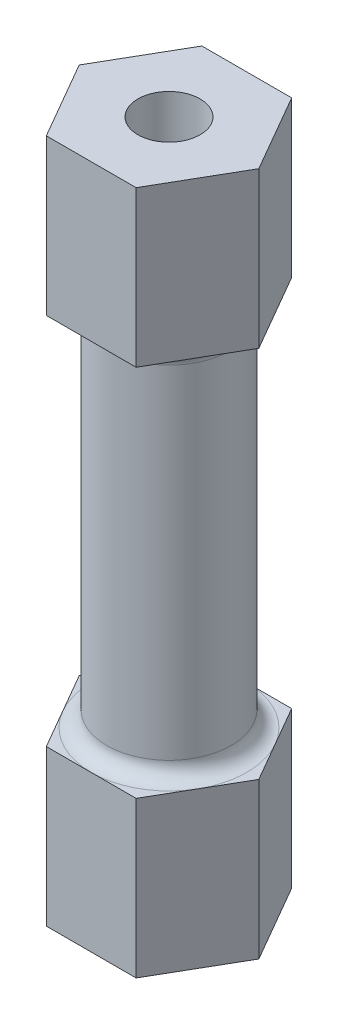
ISO-10303-21;
HEADER;
FILE_DESCRIPTION(('STEP AP214'),'2;1');
FILE_NAME('part.step','',(''),(''),'','','');
FILE_SCHEMA(('AUTOMOTIVE_DESIGN { 1 0 10303 214 1 1 1 1 }'));
ENDSEC;
DATA;
#1=APPLICATION_CONTEXT('core data for automotive mechanical design processes');
#2=APPLICATION_PROTOCOL_DEFINITION('international standard','automotive_design',2000,#1);
#3=PRODUCT_CONTEXT('',#1,'mechanical');
#4=PRODUCT('Part','Part','',(#3));
#5=PRODUCT_RELATED_PRODUCT_CATEGORY('part','',(#4));
#6=PRODUCT_DEFINITION_FORMATION('','',#4);
#7=PRODUCT_DEFINITION_CONTEXT('part definition',#1,'design');
#8=PRODUCT_DEFINITION('design','',#6,#7);
#9=PRODUCT_DEFINITION_SHAPE('','',#8);
#10=(LENGTH_UNIT() NAMED_UNIT(*) SI_UNIT(.MILLI.,.METRE.));
#11=(NAMED_UNIT(*) PLANE_ANGLE_UNIT() SI_UNIT($,.RADIAN.));
#12=(NAMED_UNIT(*) SI_UNIT($,.STERADIAN.) SOLID_ANGLE_UNIT());
#13=UNCERTAINTY_MEASURE_WITH_UNIT(LENGTH_MEASURE(1.E-05),#10,'distance_accuracy_value','');
#14=(GEOMETRIC_REPRESENTATION_CONTEXT(3) GLOBAL_UNCERTAINTY_ASSIGNED_CONTEXT((#13)) GLOBAL_UNIT_ASSIGNED_CONTEXT((#10,
#11,#12)) REPRESENTATION_CONTEXT('',''));
#15=CARTESIAN_POINT('',(0.,0.,0.));
#16=DIRECTION('',(0.,0.,1.));
#17=DIRECTION('',(1.,0.,0.));
#18=AXIS2_PLACEMENT_3D('',#15,#16,#17);
#19=CARTESIAN_POINT('',(0.,5.,0.));
#20=DIRECTION('',(0.,1.,0.));
#21=DIRECTION('',(0.,0.,1.));
#22=AXIS2_PLACEMENT_3D('',#19,#20,#21);
#23=PLANE('',#22);
#24=DIRECTION('',(1.,0.,0.));
#25=VECTOR('',#24,1.);
#26=CARTESIAN_POINT('',(-1.44337567297403,5.,2.5));
#27=LINE('',#26,#25);
#28=CARTESIAN_POINT('',(-1.44337567297403,5.,2.5));
#29=VERTEX_POINT('',#28);
#30=CARTESIAN_POINT('',(0.,5.,2.49999999999999));
#31=VERTEX_POINT('',#30);
#32=EDGE_CURVE('E235',#29,#31,#27,.T.);
#33=ORIENTED_EDGE('',*,*,#32,.T.);
#34=CARTESIAN_POINT('',(0.,5.,0.));
#35=DIRECTION('',(0.,1.,0.));
#36=DIRECTION('',(0.,0.,1.));
#37=AXIS2_PLACEMENT_3D('',#34,#35,#36);
#38=CIRCLE('',#37,2.5);
#39=CARTESIAN_POINT('',(-2.16506350946108,5.,1.25000000000001));
#40=VERTEX_POINT('',#39);
#41=EDGE_CURVE('E11',#31,#40,#38,.F.);
#42=ORIENTED_EDGE('',*,*,#41,.T.);
#43=DIRECTION('',(0.500000000000007,0.,0.866025403784435));
#44=VECTOR('',#43,1.);
#45=CARTESIAN_POINT('',(-2.88675134594811,5.,0.));
#46=LINE('',#45,#44);
#47=EDGE_CURVE('E229',#40,#29,#46,.T.);
#48=ORIENTED_EDGE('',*,*,#47,.T.);
#49=EDGE_LOOP('',(#33,#42,#48));
#50=FACE_BOUND('',#49,.T.);
#51=ADVANCED_FACE('F43',(#50),#23,.T.);
#52=CARTESIAN_POINT('',(-2.88675134594811,5.,0.));
#53=VERTEX_POINT('',#52);
#54=EDGE_CURVE('E230',#53,#40,#46,.T.);
#55=ORIENTED_EDGE('',*,*,#54,.T.);
#56=CARTESIAN_POINT('',(0.,5.,0.));
#57=DIRECTION('',(0.,1.,0.));
#58=DIRECTION('',(0.,0.,1.));
#59=AXIS2_PLACEMENT_3D('',#56,#57,#58);
#60=CIRCLE('',#59,2.5);
#61=CARTESIAN_POINT('',(-2.16506350946109,5.,-1.24999999999998));
#62=VERTEX_POINT('',#61);
#63=EDGE_CURVE('E52',#40,#62,#60,.F.);
#64=ORIENTED_EDGE('',*,*,#63,.T.);
#65=DIRECTION('',(-0.499999999999995,0.,0.866025403784441));
#66=VECTOR('',#65,1.);
#67=CARTESIAN_POINT('',(-1.44337567297407,5.,-2.49999999999998));
#68=LINE('',#67,#66);
#69=EDGE_CURVE('E224',#62,#53,#68,.T.);
#70=ORIENTED_EDGE('',*,*,#69,.T.);
#71=EDGE_LOOP('',(#55,#64,#70));
#72=FACE_BOUND('',#71,.T.);
#73=ADVANCED_FACE('F317',(#72),#23,.T.);
#74=CARTESIAN_POINT('',(-1.44337567297407,5.,-2.49999999999998));
#75=VERTEX_POINT('',#74);
#76=EDGE_CURVE('E225',#75,#62,#68,.T.);
#77=ORIENTED_EDGE('',*,*,#76,.T.);
#78=CARTESIAN_POINT('',(0.,5.,0.));
#79=DIRECTION('',(0.,1.,0.));
#80=DIRECTION('',(0.,0.,1.));
#81=AXIS2_PLACEMENT_3D('',#78,#79,#80);
#82=CIRCLE('',#81,2.5);
#83=CARTESIAN_POINT('',(0.,5.,-2.49999999999999));
#84=VERTEX_POINT('',#83);
#85=EDGE_CURVE('E312',#62,#84,#82,.F.);
#86=ORIENTED_EDGE('',*,*,#85,.T.);
#87=DIRECTION('',(-1.,0.,0.));
#88=VECTOR('',#87,1.);
#89=CARTESIAN_POINT('',(1.44337567297405,5.,-2.49999999999999));
#90=LINE('',#89,#88);
#91=EDGE_CURVE('E219',#84,#75,#90,.T.);
#92=ORIENTED_EDGE('',*,*,#91,.T.);
#93=EDGE_LOOP('',(#77,#86,#92));
#94=FACE_BOUND('',#93,.T.);
#95=ADVANCED_FACE('F325',(#94),#23,.T.);
#96=CARTESIAN_POINT('',(1.44337567297405,5.,-2.49999999999999));
#97=VERTEX_POINT('',#96);
#98=EDGE_CURVE('E220',#97,#84,#90,.T.);
#99=ORIENTED_EDGE('',*,*,#98,.T.);
#100=CARTESIAN_POINT('',(0.,5.,0.));
#101=DIRECTION('',(0.,1.,0.));
#102=DIRECTION('',(0.,0.,1.));
#103=AXIS2_PLACEMENT_3D('',#100,#101,#102);
#104=CIRCLE('',#103,2.5);
#105=CARTESIAN_POINT('',(2.16506350946108,5.,-1.25));
#106=VERTEX_POINT('',#105);
#107=EDGE_CURVE('E309',#84,#106,#104,.F.);
#108=ORIENTED_EDGE('',*,*,#107,.T.);
#109=DIRECTION('',(-0.500000000000001,0.,-0.866025403784438));
#110=VECTOR('',#109,1.);
#111=CARTESIAN_POINT('',(2.88675134594812,5.,0.));
#112=LINE('',#111,#110);
#113=EDGE_CURVE('E213',#106,#97,#112,.T.);
#114=ORIENTED_EDGE('',*,*,#113,.T.);
#115=EDGE_LOOP('',(#99,#108,#114));
#116=FACE_BOUND('',#115,.T.);
#117=ADVANCED_FACE('F333',(#116),#23,.T.);
#118=CARTESIAN_POINT('',(2.88675134594812,5.,0.));
#119=VERTEX_POINT('',#118);
#120=EDGE_CURVE('E215',#119,#106,#112,.T.);
#121=ORIENTED_EDGE('',*,*,#120,.T.);
#122=CARTESIAN_POINT('',(0.,5.,0.));
#123=DIRECTION('',(0.,1.,0.));
#124=DIRECTION('',(0.,0.,1.));
#125=AXIS2_PLACEMENT_3D('',#122,#123,#124);
#126=CIRCLE('',#125,2.5);
#127=CARTESIAN_POINT('',(2.1650635094611,5.,1.24999999999999));
#128=VERTEX_POINT('',#127);
#129=EDGE_CURVE('E306',#106,#128,#126,.F.);
#130=ORIENTED_EDGE('',*,*,#129,.T.);
#131=DIRECTION('',(0.499999999999995,0.,-0.866025403784441));
#132=VECTOR('',#131,1.);
#133=CARTESIAN_POINT('',(1.44337567297409,5.,2.49999999999997));
#134=LINE('',#133,#132);
#135=EDGE_CURVE('E214',#128,#119,#134,.T.);
#136=ORIENTED_EDGE('',*,*,#135,.T.);
#137=EDGE_LOOP('',(#121,#130,#136));
#138=FACE_BOUND('',#137,.T.);
#139=ADVANCED_FACE('F342',(#138),#23,.T.);
#140=CARTESIAN_POINT('',(0.,17.,0.));
#141=DIRECTION('',(0.,1.,0.));
#142=DIRECTION('',(0.,0.,1.));
#143=AXIS2_PLACEMENT_3D('',#140,#141,#142);
#144=PLANE('',#143);
#145=DIRECTION('',(1.,0.,0.));
#146=VECTOR('',#145,1.);
#147=CARTESIAN_POINT('',(-1.44337567297403,17.,2.5));
#148=LINE('',#147,#146);
#149=CARTESIAN_POINT('',(0.,17.,2.49999999999999));
#150=VERTEX_POINT('',#149);
#151=CARTESIAN_POINT('',(1.44337567297409,17.,2.49999999999997));
#152=VERTEX_POINT('',#151);
#153=EDGE_CURVE('E692',#150,#152,#148,.T.);
#154=ORIENTED_EDGE('',*,*,#153,.F.);
#155=CARTESIAN_POINT('',(0.,17.,0.));
#156=DIRECTION('',(0.,1.,0.));
#157=DIRECTION('',(0.,0.,1.));
#158=AXIS2_PLACEMENT_3D('',#155,#156,#157);
#159=CIRCLE('',#158,2.5);
#160=CARTESIAN_POINT('',(2.1650635094611,17.,1.24999999999999));
#161=VERTEX_POINT('',#160);
#162=EDGE_CURVE('E292',#150,#161,#159,.T.);
#163=ORIENTED_EDGE('',*,*,#162,.T.);
#164=DIRECTION('',(0.499999999999995,0.,-0.866025403784441));
#165=VECTOR('',#164,1.);
#166=CARTESIAN_POINT('',(1.44337567297409,17.,2.49999999999997));
#167=LINE('',#166,#165);
#168=EDGE_CURVE('E663',#152,#161,#167,.T.);
#169=ORIENTED_EDGE('',*,*,#168,.F.);
#170=EDGE_LOOP('',(#154,#163,#169));
#171=FACE_BOUND('',#170,.T.);
#172=ADVANCED_FACE('F390',(#171),#144,.F.);
#173=CARTESIAN_POINT('',(2.88675134594812,17.,0.));
#174=VERTEX_POINT('',#173);
#175=EDGE_CURVE('E196',#161,#174,#167,.T.);
#176=ORIENTED_EDGE('',*,*,#175,.F.);
#177=CARTESIAN_POINT('',(0.,17.,0.));
#178=DIRECTION('',(0.,1.,0.));
#179=DIRECTION('',(0.,0.,1.));
#180=AXIS2_PLACEMENT_3D('',#177,#178,#179);
#181=CIRCLE('',#180,2.5);
#182=CARTESIAN_POINT('',(2.16506350946108,17.,-1.25));
#183=VERTEX_POINT('',#182);
#184=EDGE_CURVE('E289',#161,#183,#181,.T.);
#185=ORIENTED_EDGE('',*,*,#184,.T.);
#186=DIRECTION('',(-0.500000000000001,0.,-0.866025403784438));
#187=VECTOR('',#186,1.);
#188=CARTESIAN_POINT('',(2.88675134594812,17.,0.));
#189=LINE('',#188,#187);
#190=EDGE_CURVE('E661',#174,#183,#189,.T.);
#191=ORIENTED_EDGE('',*,*,#190,.F.);
#192=EDGE_LOOP('',(#176,#185,#191));
#193=FACE_BOUND('',#192,.T.);
#194=ADVANCED_FACE('F395',(#193),#144,.F.);
#195=CARTESIAN_POINT('',(1.44337567297405,17.,-2.49999999999999));
#196=VERTEX_POINT('',#195);
#197=EDGE_CURVE('E670',#183,#196,#189,.T.);
#198=ORIENTED_EDGE('',*,*,#197,.F.);
#199=CARTESIAN_POINT('',(0.,17.,0.));
#200=DIRECTION('',(0.,1.,0.));
#201=DIRECTION('',(0.,0.,1.));
#202=AXIS2_PLACEMENT_3D('',#199,#200,#201);
#203=CIRCLE('',#202,2.5);
#204=CARTESIAN_POINT('',(0.,17.,-2.49999999999999));
#205=VERTEX_POINT('',#204);
#206=EDGE_CURVE('E286',#183,#205,#203,.T.);
#207=ORIENTED_EDGE('',*,*,#206,.T.);
#208=DIRECTION('',(-1.,0.,0.));
#209=VECTOR('',#208,1.);
#210=CARTESIAN_POINT('',(1.44337567297405,17.,-2.49999999999999));
#211=LINE('',#210,#209);
#212=EDGE_CURVE('E678',#196,#205,#211,.T.);
#213=ORIENTED_EDGE('',*,*,#212,.F.);
#214=EDGE_LOOP('',(#198,#207,#213));
#215=FACE_BOUND('',#214,.T.);
#216=ADVANCED_FACE('F613',(#215),#144,.F.);
#217=CARTESIAN_POINT('',(-1.44337567297407,17.,-2.49999999999998));
#218=VERTEX_POINT('',#217);
#219=EDGE_CURVE('E677',#205,#218,#211,.T.);
#220=ORIENTED_EDGE('',*,*,#219,.F.);
#221=CARTESIAN_POINT('',(0.,17.,0.));
#222=DIRECTION('',(0.,1.,0.));
#223=DIRECTION('',(0.,0.,1.));
#224=AXIS2_PLACEMENT_3D('',#221,#222,#223);
#225=CIRCLE('',#224,2.5);
#226=CARTESIAN_POINT('',(-2.16506350946109,17.,-1.24999999999998));
#227=VERTEX_POINT('',#226);
#228=EDGE_CURVE('E283',#205,#227,#225,.T.);
#229=ORIENTED_EDGE('',*,*,#228,.T.);
#230=DIRECTION('',(-0.499999999999995,0.,0.866025403784441));
#231=VECTOR('',#230,1.);
#232=CARTESIAN_POINT('',(-1.44337567297407,17.,-2.49999999999998));
#233=LINE('',#232,#231);
#234=EDGE_CURVE('E683',#218,#227,#233,.T.);
#235=ORIENTED_EDGE('',*,*,#234,.F.);
#236=EDGE_LOOP('',(#220,#229,#235));
#237=FACE_BOUND('',#236,.T.);
#238=ADVANCED_FACE('F367',(#237),#144,.F.);
#239=CARTESIAN_POINT('',(-2.88675134594811,17.,0.));
#240=VERTEX_POINT('',#239);
#241=EDGE_CURVE('E682',#227,#240,#233,.T.);
#242=ORIENTED_EDGE('',*,*,#241,.F.);
#243=CARTESIAN_POINT('',(0.,17.,0.));
#244=DIRECTION('',(0.,1.,0.));
#245=DIRECTION('',(0.,0.,1.));
#246=AXIS2_PLACEMENT_3D('',#243,#244,#245);
#247=CIRCLE('',#246,2.5);
#248=CARTESIAN_POINT('',(-2.16506350946107,17.,1.25000000000001));
#249=VERTEX_POINT('',#248);
#250=EDGE_CURVE('E280',#227,#249,#247,.T.);
#251=ORIENTED_EDGE('',*,*,#250,.T.);
#252=DIRECTION('',(0.500000000000007,0.,0.866025403784434));
#253=VECTOR('',#252,1.);
#254=CARTESIAN_POINT('',(-2.88675134594811,17.,0.));
#255=LINE('',#254,#253);
#256=EDGE_CURVE('E688',#240,#249,#255,.T.);
#257=ORIENTED_EDGE('',*,*,#256,.F.);
#258=EDGE_LOOP('',(#242,#251,#257));
#259=FACE_BOUND('',#258,.T.);
#260=ADVANCED_FACE('F359',(#259),#144,.F.);
#261=CARTESIAN_POINT('',(1.44337567297409,5.,2.49999999999997));
#262=DIRECTION('',(-0.866025403784441,0.,-0.499999999999995));
#263=DIRECTION('',(-0.499999999999995,0.,0.866025403784441));
#264=AXIS2_PLACEMENT_3D('',#261,#262,#263);
#265=PLANE('',#264);
#266=DIRECTION('',(0.499999999999995,0.,-0.866025403784441));
#267=VECTOR('',#266,1.);
#268=CARTESIAN_POINT('',(1.44337567297409,0.,2.49999999999997));
#269=LINE('',#268,#267);
#270=CARTESIAN_POINT('',(1.44337567297409,0.,2.49999999999997));
#271=VERTEX_POINT('',#270);
#272=CARTESIAN_POINT('',(2.88675134594812,0.,0.));
#273=VERTEX_POINT('',#272);
#274=EDGE_CURVE('E199',#271,#273,#269,.T.);
#275=ORIENTED_EDGE('',*,*,#274,.T.);
#276=DIRECTION('',(0.,-1.,0.));
#277=VECTOR('',#276,1.);
#278=CARTESIAN_POINT('',(2.88675134594812,5.,0.));
#279=LINE('',#278,#277);
#280=EDGE_CURVE('E273',#119,#273,#279,.T.);
#281=ORIENTED_EDGE('',*,*,#280,.F.);
#282=ORIENTED_EDGE('',*,*,#135,.F.);
#283=CARTESIAN_POINT('',(1.44337567297409,5.,2.49999999999997));
#284=VERTEX_POINT('',#283);
#285=EDGE_CURVE('E210',#284,#128,#134,.T.);
#286=ORIENTED_EDGE('',*,*,#285,.F.);
#287=DIRECTION('',(0.,-1.,0.));
#288=VECTOR('',#287,1.);
#289=CARTESIAN_POINT('',(1.44337567297409,5.,2.49999999999997));
#290=LINE('',#289,#288);
#291=EDGE_CURVE('E238',#284,#271,#290,.T.);
#292=ORIENTED_EDGE('',*,*,#291,.T.);
#293=EDGE_LOOP('',(#275,#281,#282,#286,#292));
#294=FACE_BOUND('',#293,.T.);
#295=ADVANCED_FACE('F357',(#294),#265,.F.);
#296=CARTESIAN_POINT('',(2.88675134594812,5.,0.));
#297=DIRECTION('',(-0.866025403784438,0.,0.500000000000001));
#298=DIRECTION('',(0.500000000000001,0.,0.866025403784438));
#299=AXIS2_PLACEMENT_3D('',#296,#297,#298);
#300=PLANE('',#299);
#301=DIRECTION('',(-0.500000000000001,0.,-0.866025403784438));
#302=VECTOR('',#301,1.);
#303=CARTESIAN_POINT('',(2.88675134594812,0.,0.));
#304=LINE('',#303,#302);
#305=CARTESIAN_POINT('',(1.44337567297405,0.,-2.49999999999999));
#306=VERTEX_POINT('',#305);
#307=EDGE_CURVE('E204',#273,#306,#304,.T.);
#308=ORIENTED_EDGE('',*,*,#307,.T.);
#309=DIRECTION('',(0.,-1.,0.));
#310=VECTOR('',#309,1.);
#311=CARTESIAN_POINT('',(1.44337567297405,5.,-2.49999999999999));
#312=LINE('',#311,#310);
#313=EDGE_CURVE('E269',#97,#306,#312,.T.);
#314=ORIENTED_EDGE('',*,*,#313,.F.);
#315=ORIENTED_EDGE('',*,*,#113,.F.);
#316=ORIENTED_EDGE('',*,*,#120,.F.);
#317=ORIENTED_EDGE('',*,*,#280,.T.);
#318=EDGE_LOOP('',(#308,#314,#315,#316,#317));
#319=FACE_BOUND('',#318,.T.);
#320=ADVANCED_FACE('F338',(#319),#300,.F.);
#321=CARTESIAN_POINT('',(1.44337567297405,5.,-2.49999999999999));
#322=DIRECTION('',(0.,0.,1.));
#323=DIRECTION('',(1.,0.,0.));
#324=AXIS2_PLACEMENT_3D('',#321,#322,#323);
#325=PLANE('',#324);
#326=DIRECTION('',(-1.,0.,0.));
#327=VECTOR('',#326,1.);
#328=CARTESIAN_POINT('',(1.44337567297405,0.,-2.49999999999999));
#329=LINE('',#328,#327);
#330=CARTESIAN_POINT('',(-1.44337567297407,0.,-2.49999999999998));
#331=VERTEX_POINT('',#330);
#332=EDGE_CURVE('E242',#306,#331,#329,.T.);
#333=ORIENTED_EDGE('',*,*,#332,.T.);
#334=DIRECTION('',(0.,-1.,0.));
#335=VECTOR('',#334,1.);
#336=CARTESIAN_POINT('',(-1.44337567297407,5.,-2.49999999999998));
#337=LINE('',#336,#335);
#338=EDGE_CURVE('E265',#75,#331,#337,.T.);
#339=ORIENTED_EDGE('',*,*,#338,.F.);
#340=ORIENTED_EDGE('',*,*,#91,.F.);
#341=ORIENTED_EDGE('',*,*,#98,.F.);
#342=ORIENTED_EDGE('',*,*,#313,.T.);
#343=EDGE_LOOP('',(#333,#339,#340,#341,#342));
#344=FACE_BOUND('',#343,.T.);
#345=ADVANCED_FACE('F365',(#344),#325,.F.);
#346=CARTESIAN_POINT('',(-1.44337567297407,5.,-2.49999999999998));
#347=DIRECTION('',(0.866025403784442,0.,0.499999999999995));
#348=DIRECTION('',(0.499999999999995,0.,-0.866025403784442));
#349=AXIS2_PLACEMENT_3D('',#346,#347,#348);
#350=PLANE('',#349);
#351=DIRECTION('',(-0.499999999999995,0.,0.866025403784441));
#352=VECTOR('',#351,1.);
#353=CARTESIAN_POINT('',(-1.44337567297407,0.,-2.49999999999998));
#354=LINE('',#353,#352);
#355=CARTESIAN_POINT('',(-2.88675134594811,0.,0.));
#356=VERTEX_POINT('',#355);
#357=EDGE_CURVE('E245',#331,#356,#354,.T.);
#358=ORIENTED_EDGE('',*,*,#357,.T.);
#359=DIRECTION('',(0.,-1.,0.));
#360=VECTOR('',#359,1.);
#361=CARTESIAN_POINT('',(-2.88675134594811,5.,0.));
#362=LINE('',#361,#360);
#363=EDGE_CURVE('E261',#53,#356,#362,.T.);
#364=ORIENTED_EDGE('',*,*,#363,.F.);
#365=ORIENTED_EDGE('',*,*,#69,.F.);
#366=ORIENTED_EDGE('',*,*,#76,.F.);
#367=ORIENTED_EDGE('',*,*,#338,.T.);
#368=EDGE_LOOP('',(#358,#364,#365,#366,#367));
#369=FACE_BOUND('',#368,.T.);
#370=ADVANCED_FACE('F322',(#369),#350,.F.);
#371=CARTESIAN_POINT('',(-2.88675134594811,5.,0.));
#372=DIRECTION('',(0.866025403784435,0.,-0.500000000000007));
#373=DIRECTION('',(-0.500000000000007,0.,-0.866025403784435));
#374=AXIS2_PLACEMENT_3D('',#371,#372,#373);
#375=PLANE('',#374);
#376=DIRECTION('',(0.500000000000007,0.,0.866025403784435));
#377=VECTOR('',#376,1.);
#378=CARTESIAN_POINT('',(-2.88675134594811,0.,0.));
#379=LINE('',#378,#377);
#380=CARTESIAN_POINT('',(-1.44337567297403,0.,2.5));
#381=VERTEX_POINT('',#380);
#382=EDGE_CURVE('E248',#356,#381,#379,.T.);
#383=ORIENTED_EDGE('',*,*,#382,.T.);
#384=DIRECTION('',(0.,-1.,0.));
#385=VECTOR('',#384,1.);
#386=CARTESIAN_POINT('',(-1.44337567297403,5.,2.5));
#387=LINE('',#386,#385);
#388=EDGE_CURVE('E257',#29,#381,#387,.T.);
#389=ORIENTED_EDGE('',*,*,#388,.F.);
#390=ORIENTED_EDGE('',*,*,#47,.F.);
#391=ORIENTED_EDGE('',*,*,#54,.F.);
#392=ORIENTED_EDGE('',*,*,#363,.T.);
#393=EDGE_LOOP('',(#383,#389,#390,#391,#392));
#394=FACE_BOUND('',#393,.T.);
#395=ADVANCED_FACE('F387',(#394),#375,.F.);
#396=CARTESIAN_POINT('',(-1.44337567297403,5.,2.5));
#397=DIRECTION('',(0.,0.,-1.));
#398=DIRECTION('',(-1.,0.,0.));
#399=AXIS2_PLACEMENT_3D('',#396,#397,#398);
#400=PLANE('',#399);
#401=DIRECTION('',(1.,0.,0.));
#402=VECTOR('',#401,1.);
#403=CARTESIAN_POINT('',(-1.44337567297403,0.,2.5));
#404=LINE('',#403,#402);
#405=EDGE_CURVE('E251',#381,#271,#404,.T.);
#406=ORIENTED_EDGE('',*,*,#405,.T.);
#407=ORIENTED_EDGE('',*,*,#291,.F.);
#408=EDGE_CURVE('E234',#31,#284,#27,.T.);
#409=ORIENTED_EDGE('',*,*,#408,.F.);
#410=ORIENTED_EDGE('',*,*,#32,.F.);
#411=ORIENTED_EDGE('',*,*,#388,.T.);
#412=EDGE_LOOP('',(#406,#407,#409,#410,#411));
#413=FACE_BOUND('',#412,.T.);
#414=ADVANCED_FACE('F354',(#413),#400,.F.);
#415=ORIENTED_EDGE('',*,*,#285,.T.);
#416=CARTESIAN_POINT('',(0.,5.,0.));
#417=DIRECTION('',(0.,1.,0.));
#418=DIRECTION('',(0.,0.,1.));
#419=AXIS2_PLACEMENT_3D('',#416,#417,#418);
#420=CIRCLE('',#419,2.5);
#421=EDGE_CURVE('E59',#128,#31,#420,.F.);
#422=ORIENTED_EDGE('',*,*,#421,.T.);
#423=ORIENTED_EDGE('',*,*,#408,.T.);
#424=EDGE_LOOP('',(#415,#422,#423));
#425=FACE_BOUND('',#424,.T.);
#426=ADVANCED_FACE('F351',(#425),#23,.T.);
#427=CARTESIAN_POINT('',(0.,0.,0.));
#428=DIRECTION('',(0.,1.,0.));
#429=DIRECTION('',(0.,0.,1.));
#430=AXIS2_PLACEMENT_3D('',#427,#428,#429);
#431=PLANE('',#430);
#432=CARTESIAN_POINT('',(0.,0.,0.));
#433=DIRECTION('',(0.,-1.,0.));
#434=DIRECTION('',(0.,0.,-1.));
#435=AXIS2_PLACEMENT_3D('',#432,#433,#434);
#436=CIRCLE('',#435,1.);
#437=CARTESIAN_POINT('',(0.,0.,-1.));
#438=VERTEX_POINT('',#437);
#439=EDGE_CURVE('E738',#438,#438,#436,.T.);
#440=ORIENTED_EDGE('',*,*,#439,.F.);
#441=EDGE_LOOP('',(#440));
#442=FACE_BOUND('',#441,.T.);
#443=ORIENTED_EDGE('',*,*,#274,.F.);
#444=ORIENTED_EDGE('',*,*,#405,.F.);
#445=ORIENTED_EDGE('',*,*,#382,.F.);
#446=ORIENTED_EDGE('',*,*,#357,.F.);
#447=ORIENTED_EDGE('',*,*,#332,.F.);
#448=ORIENTED_EDGE('',*,*,#307,.F.);
#449=EDGE_LOOP('',(#443,#444,#445,#446,#447,#448));
#450=FACE_BOUND('',#449,.T.);
#451=ADVANCED_FACE('F380',(#442,#450),#431,.F.);
#452=CARTESIAN_POINT('',(0.,17.,0.));
#453=DIRECTION('',(0.,-1.,0.));
#454=DIRECTION('',(0.,0.,-1.));
#455=AXIS2_PLACEMENT_3D('',#452,#453,#454);
#456=CYLINDRICAL_SURFACE('',#455,2.);
#457=CARTESIAN_POINT('',(0.,16.5,0.));
#458=DIRECTION('',(0.,1.,0.));
#459=DIRECTION('',(0.,0.,1.));
#460=AXIS2_PLACEMENT_3D('',#457,#458,#459);
#461=CIRCLE('',#460,2.);
#462=CARTESIAN_POINT('',(0.,16.5,2.));
#463=VERTEX_POINT('',#462);
#464=EDGE_CURVE('E300',#463,#463,#461,.F.);
#465=ORIENTED_EDGE('',*,*,#464,.T.);
#466=EDGE_LOOP('',(#465));
#467=FACE_BOUND('',#466,.T.);
#468=CARTESIAN_POINT('',(0.,5.5,0.));
#469=DIRECTION('',(0.,1.,0.));
#470=DIRECTION('',(0.,0.,1.));
#471=AXIS2_PLACEMENT_3D('',#468,#469,#470);
#472=CIRCLE('',#471,2.);
#473=CARTESIAN_POINT('',(0.,5.5,2.));
#474=VERTEX_POINT('',#473);
#475=EDGE_CURVE('E296',#474,#474,#472,.T.);
#476=ORIENTED_EDGE('',*,*,#475,.T.);
#477=EDGE_LOOP('',(#476));
#478=FACE_BOUND('',#477,.T.);
#479=ADVANCED_FACE('F385',(#467,#478),#456,.T.);
#480=CARTESIAN_POINT('',(1.44337567297409,22.,2.49999999999997));
#481=DIRECTION('',(-0.866025403784441,0.,-0.499999999999995));
#482=DIRECTION('',(-0.499999999999995,0.,0.866025403784441));
#483=AXIS2_PLACEMENT_3D('',#480,#481,#482);
#484=PLANE('',#483);
#485=ORIENTED_EDGE('',*,*,#168,.T.);
#486=ORIENTED_EDGE('',*,*,#175,.T.);
#487=DIRECTION('',(0.,-1.,0.));
#488=VECTOR('',#487,1.);
#489=CARTESIAN_POINT('',(2.88675134594812,22.,0.));
#490=LINE('',#489,#488);
#491=CARTESIAN_POINT('',(2.88675134594812,22.,0.));
#492=VERTEX_POINT('',#491);
#493=EDGE_CURVE('E174',#492,#174,#490,.T.);
#494=ORIENTED_EDGE('',*,*,#493,.F.);
#495=DIRECTION('',(0.499999999999995,0.,-0.866025403784441));
#496=VECTOR('',#495,1.);
#497=CARTESIAN_POINT('',(1.44337567297409,22.,2.49999999999997));
#498=LINE('',#497,#496);
#499=CARTESIAN_POINT('',(1.44337567297409,22.,2.49999999999997));
#500=VERTEX_POINT('',#499);
#501=EDGE_CURVE('E181',#500,#492,#498,.T.);
#502=ORIENTED_EDGE('',*,*,#501,.F.);
#503=DIRECTION('',(0.,-1.,0.));
#504=VECTOR('',#503,1.);
#505=CARTESIAN_POINT('',(1.44337567297409,22.,2.49999999999997));
#506=LINE('',#505,#504);
#507=EDGE_CURVE('E667',#500,#152,#506,.T.);
#508=ORIENTED_EDGE('',*,*,#507,.T.);
#509=EDGE_LOOP('',(#485,#486,#494,#502,#508));
#510=FACE_BOUND('',#509,.T.);
#511=ADVANCED_FACE('F194',(#510),#484,.F.);
#512=CARTESIAN_POINT('',(2.88675134594812,22.,0.));
#513=DIRECTION('',(-0.866025403784438,0.,0.500000000000001));
#514=DIRECTION('',(0.500000000000001,0.,0.866025403784438));
#515=AXIS2_PLACEMENT_3D('',#512,#513,#514);
#516=PLANE('',#515);
#517=ORIENTED_EDGE('',*,*,#190,.T.);
#518=ORIENTED_EDGE('',*,*,#197,.T.);
#519=DIRECTION('',(0.,-1.,0.));
#520=VECTOR('',#519,1.);
#521=CARTESIAN_POINT('',(1.44337567297405,22.,-2.49999999999999));
#522=LINE('',#521,#520);
#523=CARTESIAN_POINT('',(1.44337567297405,22.,-2.49999999999999));
#524=VERTEX_POINT('',#523);
#525=EDGE_CURVE('E176',#524,#196,#522,.T.);
#526=ORIENTED_EDGE('',*,*,#525,.F.);
#527=DIRECTION('',(-0.500000000000001,0.,-0.866025403784438));
#528=VECTOR('',#527,1.);
#529=CARTESIAN_POINT('',(2.88675134594812,22.,0.));
#530=LINE('',#529,#528);
#531=EDGE_CURVE('E169',#492,#524,#530,.T.);
#532=ORIENTED_EDGE('',*,*,#531,.F.);
#533=ORIENTED_EDGE('',*,*,#493,.T.);
#534=EDGE_LOOP('',(#517,#518,#526,#532,#533));
#535=FACE_BOUND('',#534,.T.);
#536=ADVANCED_FACE('F172',(#535),#516,.F.);
#537=CARTESIAN_POINT('',(1.44337567297405,22.,-2.49999999999999));
#538=DIRECTION('',(0.,0.,1.));
#539=DIRECTION('',(1.,0.,0.));
#540=AXIS2_PLACEMENT_3D('',#537,#538,#539);
#541=PLANE('',#540);
#542=ORIENTED_EDGE('',*,*,#212,.T.);
#543=ORIENTED_EDGE('',*,*,#219,.T.);
#544=DIRECTION('',(0.,-1.,0.));
#545=VECTOR('',#544,1.);
#546=CARTESIAN_POINT('',(-1.44337567297407,22.,-2.49999999999998));
#547=LINE('',#546,#545);
#548=CARTESIAN_POINT('',(-1.44337567297407,22.,-2.49999999999998));
#549=VERTEX_POINT('',#548);
#550=EDGE_CURVE('E206',#549,#218,#547,.T.);
#551=ORIENTED_EDGE('',*,*,#550,.F.);
#552=DIRECTION('',(-1.,0.,0.));
#553=VECTOR('',#552,1.);
#554=CARTESIAN_POINT('',(1.44337567297405,22.,-2.49999999999999));
#555=LINE('',#554,#553);
#556=EDGE_CURVE('E180',#524,#549,#555,.T.);
#557=ORIENTED_EDGE('',*,*,#556,.F.);
#558=ORIENTED_EDGE('',*,*,#525,.T.);
#559=EDGE_LOOP('',(#542,#543,#551,#557,#558));
#560=FACE_BOUND('',#559,.T.);
#561=ADVANCED_FACE('F509',(#560),#541,.F.);
#562=CARTESIAN_POINT('',(-1.44337567297407,22.,-2.49999999999998));
#563=DIRECTION('',(0.866025403784442,0.,0.499999999999995));
#564=DIRECTION('',(0.499999999999995,0.,-0.866025403784442));
#565=AXIS2_PLACEMENT_3D('',#562,#563,#564);
#566=PLANE('',#565);
#567=ORIENTED_EDGE('',*,*,#234,.T.);
#568=ORIENTED_EDGE('',*,*,#241,.T.);
#569=DIRECTION('',(0.,-1.,0.));
#570=VECTOR('',#569,1.);
#571=CARTESIAN_POINT('',(-2.88675134594811,22.,0.));
#572=LINE('',#571,#570);
#573=CARTESIAN_POINT('',(-2.88675134594811,22.,0.));
#574=VERTEX_POINT('',#573);
#575=EDGE_CURVE('E702',#574,#240,#572,.T.);
#576=ORIENTED_EDGE('',*,*,#575,.F.);
#577=DIRECTION('',(-0.499999999999995,0.,0.866025403784441));
#578=VECTOR('',#577,1.);
#579=CARTESIAN_POINT('',(-1.44337567297407,22.,-2.49999999999998));
#580=LINE('',#579,#578);
#581=EDGE_CURVE('E712',#549,#574,#580,.T.);
#582=ORIENTED_EDGE('',*,*,#581,.F.);
#583=ORIENTED_EDGE('',*,*,#550,.T.);
#584=EDGE_LOOP('',(#567,#568,#576,#582,#583));
#585=FACE_BOUND('',#584,.T.);
#586=ADVANCED_FACE('F498',(#585),#566,.F.);
#587=CARTESIAN_POINT('',(-2.88675134594811,22.,0.));
#588=DIRECTION('',(0.866025403784435,0.,-0.500000000000007));
#589=DIRECTION('',(-0.500000000000007,0.,-0.866025403784435));
#590=AXIS2_PLACEMENT_3D('',#587,#588,#589);
#591=PLANE('',#590);
#592=ORIENTED_EDGE('',*,*,#256,.T.);
#593=CARTESIAN_POINT('',(-1.44337567297403,17.,2.5));
#594=VERTEX_POINT('',#593);
#595=EDGE_CURVE('E687',#249,#594,#255,.T.);
#596=ORIENTED_EDGE('',*,*,#595,.T.);
#597=DIRECTION('',(0.,-1.,0.));
#598=VECTOR('',#597,1.);
#599=CARTESIAN_POINT('',(-1.44337567297403,22.,2.5));
#600=LINE('',#599,#598);
#601=CARTESIAN_POINT('',(-1.44337567297403,22.,2.5));
#602=VERTEX_POINT('',#601);
#603=EDGE_CURVE('E698',#602,#594,#600,.T.);
#604=ORIENTED_EDGE('',*,*,#603,.F.);
#605=DIRECTION('',(0.500000000000007,0.,0.866025403784434));
#606=VECTOR('',#605,1.);
#607=CARTESIAN_POINT('',(-2.88675134594811,22.,0.));
#608=LINE('',#607,#606);
#609=EDGE_CURVE('E730',#574,#602,#608,.T.);
#610=ORIENTED_EDGE('',*,*,#609,.F.);
#611=ORIENTED_EDGE('',*,*,#575,.T.);
#612=EDGE_LOOP('',(#592,#596,#604,#610,#611));
#613=FACE_BOUND('',#612,.T.);
#614=ADVANCED_FACE('F487',(#613),#591,.F.);
#615=CARTESIAN_POINT('',(-1.44337567297403,22.,2.5));
#616=DIRECTION('',(0.,0.,-1.));
#617=DIRECTION('',(-1.,0.,0.));
#618=AXIS2_PLACEMENT_3D('',#615,#616,#617);
#619=PLANE('',#618);
#620=EDGE_CURVE('E191',#594,#150,#148,.T.);
#621=ORIENTED_EDGE('',*,*,#620,.T.);
#622=ORIENTED_EDGE('',*,*,#153,.T.);
#623=ORIENTED_EDGE('',*,*,#507,.F.);
#624=DIRECTION('',(1.,0.,0.));
#625=VECTOR('',#624,1.);
#626=CARTESIAN_POINT('',(-1.44337567297403,22.,2.5));
#627=LINE('',#626,#625);
#628=EDGE_CURVE('E186',#602,#500,#627,.T.);
#629=ORIENTED_EDGE('',*,*,#628,.F.);
#630=ORIENTED_EDGE('',*,*,#603,.T.);
#631=EDGE_LOOP('',(#621,#622,#623,#629,#630));
#632=FACE_BOUND('',#631,.T.);
#633=ADVANCED_FACE('F452',(#632),#619,.F.);
#634=CARTESIAN_POINT('',(0.,22.,0.));
#635=DIRECTION('',(0.,1.,0.));
#636=DIRECTION('',(0.,0.,1.));
#637=AXIS2_PLACEMENT_3D('',#634,#635,#636);
#638=PLANE('',#637);
#639=CARTESIAN_POINT('',(0.,22.,0.));
#640=DIRECTION('',(0.,-1.,0.));
#641=DIRECTION('',(0.,0.,-1.));
#642=AXIS2_PLACEMENT_3D('',#639,#640,#641);
#643=CIRCLE('',#642,1.);
#644=CARTESIAN_POINT('',(0.,22.,-1.));
#645=VERTEX_POINT('',#644);
#646=EDGE_CURVE('E664',#645,#645,#643,.T.);
#647=ORIENTED_EDGE('',*,*,#646,.T.);
#648=EDGE_LOOP('',(#647));
#649=FACE_BOUND('',#648,.T.);
#650=ORIENTED_EDGE('',*,*,#501,.T.);
#651=ORIENTED_EDGE('',*,*,#531,.T.);
#652=ORIENTED_EDGE('',*,*,#556,.T.);
#653=ORIENTED_EDGE('',*,*,#581,.T.);
#654=ORIENTED_EDGE('',*,*,#609,.T.);
#655=ORIENTED_EDGE('',*,*,#628,.T.);
#656=EDGE_LOOP('',(#650,#651,#652,#653,#654,#655));
#657=FACE_BOUND('',#656,.T.);
#658=ADVANCED_FACE('F184',(#649,#657),#638,.T.);
#659=ORIENTED_EDGE('',*,*,#595,.F.);
#660=CARTESIAN_POINT('',(0.,17.,0.));
#661=DIRECTION('',(0.,1.,0.));
#662=DIRECTION('',(0.,0.,1.));
#663=AXIS2_PLACEMENT_3D('',#660,#661,#662);
#664=CIRCLE('',#663,2.5);
#665=EDGE_CURVE('E277',#249,#150,#664,.T.);
#666=ORIENTED_EDGE('',*,*,#665,.T.);
#667=ORIENTED_EDGE('',*,*,#620,.F.);
#668=EDGE_LOOP('',(#659,#666,#667));
#669=FACE_BOUND('',#668,.T.);
#670=ADVANCED_FACE('F370',(#669),#144,.F.);
#671=CARTESIAN_POINT('',(0.,16.5,0.));
#672=DIRECTION('',(0.,1.,0.));
#673=DIRECTION('',(0.,0.,1.));
#674=AXIS2_PLACEMENT_3D('',#671,#672,#673);
#675=TOROIDAL_SURFACE('',#674,2.5,0.5);
#676=ORIENTED_EDGE('',*,*,#464,.F.);
#677=EDGE_LOOP('',(#676));
#678=FACE_BOUND('',#677,.T.);
#679=ORIENTED_EDGE('',*,*,#184,.F.);
#680=ORIENTED_EDGE('',*,*,#162,.F.);
#681=ORIENTED_EDGE('',*,*,#665,.F.);
#682=ORIENTED_EDGE('',*,*,#250,.F.);
#683=ORIENTED_EDGE('',*,*,#228,.F.);
#684=ORIENTED_EDGE('',*,*,#206,.F.);
#685=EDGE_LOOP('',(#679,#680,#681,#682,#683,#684));
#686=FACE_BOUND('',#685,.T.);
#687=ADVANCED_FACE('F421',(#678,#686),#675,.F.);
#688=CARTESIAN_POINT('',(0.,5.5,0.));
#689=DIRECTION('',(0.,1.,0.));
#690=DIRECTION('',(0.,0.,1.));
#691=AXIS2_PLACEMENT_3D('',#688,#689,#690);
#692=TOROIDAL_SURFACE('',#691,2.5,0.5);
#693=ORIENTED_EDGE('',*,*,#63,.F.);
#694=ORIENTED_EDGE('',*,*,#41,.F.);
#695=ORIENTED_EDGE('',*,*,#421,.F.);
#696=ORIENTED_EDGE('',*,*,#129,.F.);
#697=ORIENTED_EDGE('',*,*,#107,.F.);
#698=ORIENTED_EDGE('',*,*,#85,.F.);
#699=EDGE_LOOP('',(#693,#694,#695,#696,#697,#698));
#700=FACE_BOUND('',#699,.T.);
#701=ORIENTED_EDGE('',*,*,#475,.F.);
#702=EDGE_LOOP('',(#701));
#703=FACE_BOUND('',#702,.T.);
#704=ADVANCED_FACE('F45',(#700,#703),#692,.F.);
#705=CARTESIAN_POINT('',(0.,22.,0.));
#706=DIRECTION('',(0.,-1.,0.));
#707=DIRECTION('',(0.,0.,-1.));
#708=AXIS2_PLACEMENT_3D('',#705,#706,#707);
#709=CYLINDRICAL_SURFACE('',#708,1.);
#710=ORIENTED_EDGE('',*,*,#646,.F.);
#711=EDGE_LOOP('',(#710));
#712=FACE_BOUND('',#711,.T.);
#713=ORIENTED_EDGE('',*,*,#439,.T.);
#714=EDGE_LOOP('',(#713));
#715=FACE_BOUND('',#714,.T.);
#716=ADVANCED_FACE('F433',(#712,#715),#709,.F.);
#717=CLOSED_SHELL('',(#51,#73,#95,#117,#139,#172,#194,#216,#238,#260,#295,#320,#345,#370,#395,
#414,#426,#451,#479,#511,#536,#561,#586,#614,#633,#658,#670,#687,#704,#716));
#718=MANIFOLD_SOLID_BREP('B2',#717);
#719=ADVANCED_BREP_SHAPE_REPRESENTATION('',(#18,#718),#14);
#720=SHAPE_DEFINITION_REPRESENTATION(#9,#719);
ENDSEC;
END-ISO-10303-21;
